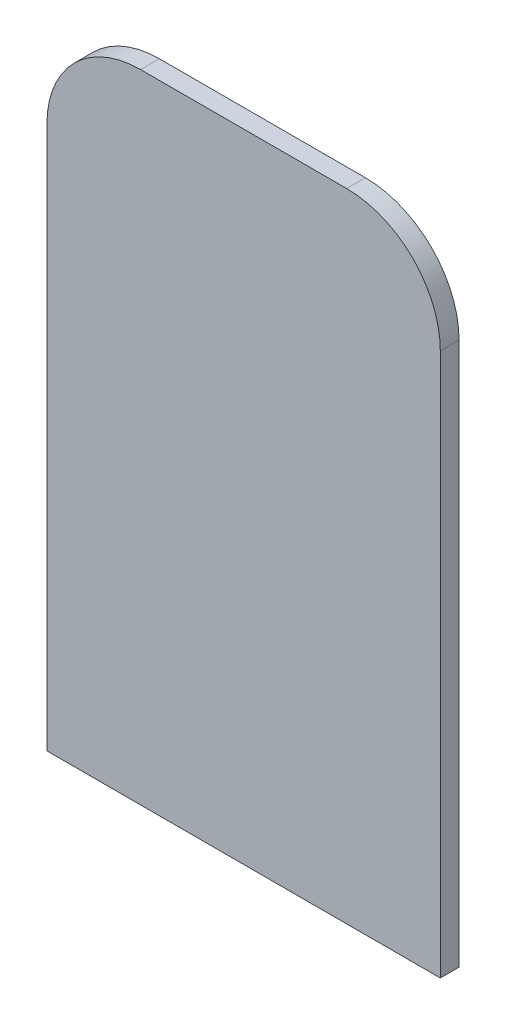
ISO-10303-21;
HEADER;
FILE_DESCRIPTION(('STEP AP214'),'2;1');
FILE_NAME('part.step','',(''),(''),'','','');
FILE_SCHEMA(('AUTOMOTIVE_DESIGN { 1 0 10303 214 1 1 1 1 }'));
ENDSEC;
DATA;
#1=APPLICATION_CONTEXT('core data for automotive mechanical design processes');
#2=APPLICATION_PROTOCOL_DEFINITION('international standard','automotive_design',2000,#1);
#3=PRODUCT_CONTEXT('',#1,'mechanical');
#4=PRODUCT('Part','Part','',(#3));
#5=PRODUCT_RELATED_PRODUCT_CATEGORY('part','',(#4));
#6=PRODUCT_DEFINITION_FORMATION('','',#4);
#7=PRODUCT_DEFINITION_CONTEXT('part definition',#1,'design');
#8=PRODUCT_DEFINITION('design','',#6,#7);
#9=PRODUCT_DEFINITION_SHAPE('','',#8);
#10=(LENGTH_UNIT() NAMED_UNIT(*) SI_UNIT(.MILLI.,.METRE.));
#11=(NAMED_UNIT(*) PLANE_ANGLE_UNIT() SI_UNIT($,.RADIAN.));
#12=(NAMED_UNIT(*) SI_UNIT($,.STERADIAN.) SOLID_ANGLE_UNIT());
#13=UNCERTAINTY_MEASURE_WITH_UNIT(LENGTH_MEASURE(1.E-05),#10,'distance_accuracy_value','');
#14=(GEOMETRIC_REPRESENTATION_CONTEXT(3) GLOBAL_UNCERTAINTY_ASSIGNED_CONTEXT((#13)) GLOBAL_UNIT_ASSIGNED_CONTEXT((#10,
#11,#12)) REPRESENTATION_CONTEXT('',''));
#15=CARTESIAN_POINT('',(0.,0.,0.));
#16=DIRECTION('',(0.,0.,1.));
#17=DIRECTION('',(1.,0.,0.));
#18=AXIS2_PLACEMENT_3D('',#15,#16,#17);
#19=CARTESIAN_POINT('',(5.5,29.,1.));
#20=DIRECTION('',(0.,0.,-1.));
#21=DIRECTION('',(-1.,0.,0.));
#22=AXIS2_PLACEMENT_3D('',#19,#20,#21);
#23=CYLINDRICAL_SURFACE('',#22,5.);
#24=CARTESIAN_POINT('',(5.5,29.,0.));
#25=DIRECTION('',(0.,0.,1.));
#26=DIRECTION('',(1.,0.,0.));
#27=AXIS2_PLACEMENT_3D('',#24,#25,#26);
#28=CIRCLE('',#27,5.);
#29=CARTESIAN_POINT('',(10.5,29.,0.));
#30=VERTEX_POINT('',#29);
#31=CARTESIAN_POINT('',(5.49999999999997,34.,0.));
#32=VERTEX_POINT('',#31);
#33=EDGE_CURVE('E158',#30,#32,#28,.T.);
#34=ORIENTED_EDGE('',*,*,#33,.T.);
#35=DIRECTION('',(0.,0.,-1.));
#36=VECTOR('',#35,1.);
#37=CARTESIAN_POINT('',(5.49999999999997,34.,1.));
#38=LINE('',#37,#36);
#39=CARTESIAN_POINT('',(5.49999999999997,34.,1.));
#40=VERTEX_POINT('',#39);
#41=EDGE_CURVE('E12',#40,#32,#38,.T.);
#42=ORIENTED_EDGE('',*,*,#41,.F.);
#43=CARTESIAN_POINT('',(5.5,29.,1.));
#44=DIRECTION('',(0.,0.,1.));
#45=DIRECTION('',(1.,0.,0.));
#46=AXIS2_PLACEMENT_3D('',#43,#44,#45);
#47=CIRCLE('',#46,5.);
#48=CARTESIAN_POINT('',(10.5,29.,1.));
#49=VERTEX_POINT('',#48);
#50=EDGE_CURVE('E137',#49,#40,#47,.T.);
#51=ORIENTED_EDGE('',*,*,#50,.F.);
#52=DIRECTION('',(0.,0.,-1.));
#53=VECTOR('',#52,1.);
#54=CARTESIAN_POINT('',(10.5,29.,1.));
#55=LINE('',#54,#53);
#56=EDGE_CURVE('E121',#49,#30,#55,.T.);
#57=ORIENTED_EDGE('',*,*,#56,.T.);
#58=EDGE_LOOP('',(#34,#42,#51,#57));
#59=FACE_BOUND('',#58,.T.);
#60=ADVANCED_FACE('F38',(#59),#23,.T.);
#61=CARTESIAN_POINT('',(-5.49999999999997,34.,1.));
#62=DIRECTION('',(0.,-1.,0.));
#63=DIRECTION('',(0.,0.,-1.));
#64=AXIS2_PLACEMENT_3D('',#61,#62,#63);
#65=PLANE('',#64);
#66=DIRECTION('',(-1.,0.,0.));
#67=VECTOR('',#66,1.);
#68=CARTESIAN_POINT('',(-5.49999999999997,34.,0.));
#69=LINE('',#68,#67);
#70=CARTESIAN_POINT('',(-5.49999999999997,34.,0.));
#71=VERTEX_POINT('',#70);
#72=EDGE_CURVE('E156',#32,#71,#69,.T.);
#73=ORIENTED_EDGE('',*,*,#72,.T.);
#74=DIRECTION('',(0.,0.,-1.));
#75=VECTOR('',#74,1.);
#76=CARTESIAN_POINT('',(-5.49999999999997,34.,1.));
#77=LINE('',#76,#75);
#78=CARTESIAN_POINT('',(-5.49999999999997,34.,1.));
#79=VERTEX_POINT('',#78);
#80=EDGE_CURVE('E46',#79,#71,#77,.T.);
#81=ORIENTED_EDGE('',*,*,#80,.F.);
#82=DIRECTION('',(-1.,0.,0.));
#83=VECTOR('',#82,1.);
#84=CARTESIAN_POINT('',(-5.49999999999997,34.,1.));
#85=LINE('',#84,#83);
#86=EDGE_CURVE('E91',#40,#79,#85,.T.);
#87=ORIENTED_EDGE('',*,*,#86,.F.);
#88=ORIENTED_EDGE('',*,*,#41,.T.);
#89=EDGE_LOOP('',(#73,#81,#87,#88));
#90=FACE_BOUND('',#89,.T.);
#91=ADVANCED_FACE('F173',(#90),#65,.F.);
#92=CARTESIAN_POINT('',(-5.5,29.,1.));
#93=DIRECTION('',(0.,0.,-1.));
#94=DIRECTION('',(-1.,0.,0.));
#95=AXIS2_PLACEMENT_3D('',#92,#93,#94);
#96=CYLINDRICAL_SURFACE('',#95,5.);
#97=CARTESIAN_POINT('',(-5.5,29.,0.));
#98=DIRECTION('',(0.,0.,1.));
#99=DIRECTION('',(-1.,0.,0.));
#100=AXIS2_PLACEMENT_3D('',#97,#98,#99);
#101=CIRCLE('',#100,5.);
#102=CARTESIAN_POINT('',(-10.5,29.,0.));
#103=VERTEX_POINT('',#102);
#104=EDGE_CURVE('E152',#71,#103,#101,.T.);
#105=ORIENTED_EDGE('',*,*,#104,.T.);
#106=DIRECTION('',(0.,0.,-1.));
#107=VECTOR('',#106,1.);
#108=CARTESIAN_POINT('',(-10.5,29.,1.));
#109=LINE('',#108,#107);
#110=CARTESIAN_POINT('',(-10.5,29.,1.));
#111=VERTEX_POINT('',#110);
#112=EDGE_CURVE('E114',#111,#103,#109,.T.);
#113=ORIENTED_EDGE('',*,*,#112,.F.);
#114=CARTESIAN_POINT('',(-5.5,29.,1.));
#115=DIRECTION('',(0.,0.,1.));
#116=DIRECTION('',(-1.,0.,0.));
#117=AXIS2_PLACEMENT_3D('',#114,#115,#116);
#118=CIRCLE('',#117,5.);
#119=EDGE_CURVE('E104',#79,#111,#118,.T.);
#120=ORIENTED_EDGE('',*,*,#119,.F.);
#121=ORIENTED_EDGE('',*,*,#80,.T.);
#122=EDGE_LOOP('',(#105,#113,#120,#121));
#123=FACE_BOUND('',#122,.T.);
#124=ADVANCED_FACE('F151',(#123),#96,.T.);
#125=CARTESIAN_POINT('',(-10.5,0.,1.));
#126=DIRECTION('',(1.,0.,0.));
#127=DIRECTION('',(0.,0.,-1.));
#128=AXIS2_PLACEMENT_3D('',#125,#126,#127);
#129=PLANE('',#128);
#130=DIRECTION('',(0.,-1.,0.));
#131=VECTOR('',#130,1.);
#132=CARTESIAN_POINT('',(-10.5,0.,0.));
#133=LINE('',#132,#131);
#134=CARTESIAN_POINT('',(-10.5,0.,0.));
#135=VERTEX_POINT('',#134);
#136=EDGE_CURVE('E113',#103,#135,#133,.T.);
#137=ORIENTED_EDGE('',*,*,#136,.T.);
#138=DIRECTION('',(0.,0.,-1.));
#139=VECTOR('',#138,1.);
#140=CARTESIAN_POINT('',(-10.5,0.,1.));
#141=LINE('',#140,#139);
#142=CARTESIAN_POINT('',(-10.5,0.,1.));
#143=VERTEX_POINT('',#142);
#144=EDGE_CURVE('E110',#143,#135,#141,.T.);
#145=ORIENTED_EDGE('',*,*,#144,.F.);
#146=DIRECTION('',(0.,-1.,0.));
#147=VECTOR('',#146,1.);
#148=CARTESIAN_POINT('',(-10.5,0.,1.));
#149=LINE('',#148,#147);
#150=EDGE_CURVE('E98',#111,#143,#149,.T.);
#151=ORIENTED_EDGE('',*,*,#150,.F.);
#152=ORIENTED_EDGE('',*,*,#112,.T.);
#153=EDGE_LOOP('',(#137,#145,#151,#152));
#154=FACE_BOUND('',#153,.T.);
#155=ADVANCED_FACE('F111',(#154),#129,.F.);
#156=CARTESIAN_POINT('',(10.5,0.,1.));
#157=DIRECTION('',(0.,1.,0.));
#158=DIRECTION('',(0.,0.,1.));
#159=AXIS2_PLACEMENT_3D('',#156,#157,#158);
#160=PLANE('',#159);
#161=DIRECTION('',(1.,0.,0.));
#162=VECTOR('',#161,1.);
#163=CARTESIAN_POINT('',(10.5,0.,0.));
#164=LINE('',#163,#162);
#165=CARTESIAN_POINT('',(10.5,0.,0.));
#166=VERTEX_POINT('',#165);
#167=EDGE_CURVE('E77',#135,#166,#164,.T.);
#168=ORIENTED_EDGE('',*,*,#167,.T.);
#169=DIRECTION('',(0.,0.,-1.));
#170=VECTOR('',#169,1.);
#171=CARTESIAN_POINT('',(10.5,0.,1.));
#172=LINE('',#171,#170);
#173=CARTESIAN_POINT('',(10.5,0.,1.));
#174=VERTEX_POINT('',#173);
#175=EDGE_CURVE('E115',#174,#166,#172,.T.);
#176=ORIENTED_EDGE('',*,*,#175,.F.);
#177=DIRECTION('',(1.,0.,0.));
#178=VECTOR('',#177,1.);
#179=CARTESIAN_POINT('',(10.5,0.,1.));
#180=LINE('',#179,#178);
#181=EDGE_CURVE('E102',#143,#174,#180,.T.);
#182=ORIENTED_EDGE('',*,*,#181,.F.);
#183=ORIENTED_EDGE('',*,*,#144,.T.);
#184=EDGE_LOOP('',(#168,#176,#182,#183));
#185=FACE_BOUND('',#184,.T.);
#186=ADVANCED_FACE('F117',(#185),#160,.F.);
#187=CARTESIAN_POINT('',(10.5,0.,1.));
#188=DIRECTION('',(-1.,0.,0.));
#189=DIRECTION('',(0.,0.,1.));
#190=AXIS2_PLACEMENT_3D('',#187,#188,#189);
#191=PLANE('',#190);
#192=DIRECTION('',(0.,1.,0.));
#193=VECTOR('',#192,1.);
#194=CARTESIAN_POINT('',(10.5,0.,0.));
#195=LINE('',#194,#193);
#196=EDGE_CURVE('E83',#166,#30,#195,.T.);
#197=ORIENTED_EDGE('',*,*,#196,.T.);
#198=ORIENTED_EDGE('',*,*,#56,.F.);
#199=DIRECTION('',(0.,1.,0.));
#200=VECTOR('',#199,1.);
#201=CARTESIAN_POINT('',(10.5,0.,1.));
#202=LINE('',#201,#200);
#203=EDGE_CURVE('E54',#174,#49,#202,.T.);
#204=ORIENTED_EDGE('',*,*,#203,.F.);
#205=ORIENTED_EDGE('',*,*,#175,.T.);
#206=EDGE_LOOP('',(#197,#198,#204,#205));
#207=FACE_BOUND('',#206,.T.);
#208=ADVANCED_FACE('F162',(#207),#191,.F.);
#209=CARTESIAN_POINT('',(5.5,29.,1.));
#210=DIRECTION('',(0.,0.,1.));
#211=DIRECTION('',(1.,0.,0.));
#212=AXIS2_PLACEMENT_3D('',#209,#210,#211);
#213=PLANE('',#212);
#214=ORIENTED_EDGE('',*,*,#50,.T.);
#215=ORIENTED_EDGE('',*,*,#86,.T.);
#216=ORIENTED_EDGE('',*,*,#119,.T.);
#217=ORIENTED_EDGE('',*,*,#150,.T.);
#218=ORIENTED_EDGE('',*,*,#181,.T.);
#219=ORIENTED_EDGE('',*,*,#203,.T.);
#220=EDGE_LOOP('',(#214,#215,#216,#217,#218,#219));
#221=FACE_BOUND('',#220,.T.);
#222=ADVANCED_FACE('F100',(#221),#213,.T.);
#223=CARTESIAN_POINT('',(5.5,29.,0.));
#224=DIRECTION('',(0.,0.,1.));
#225=DIRECTION('',(1.,0.,0.));
#226=AXIS2_PLACEMENT_3D('',#223,#224,#225);
#227=PLANE('',#226);
#228=ORIENTED_EDGE('',*,*,#33,.F.);
#229=ORIENTED_EDGE('',*,*,#196,.F.);
#230=ORIENTED_EDGE('',*,*,#167,.F.);
#231=ORIENTED_EDGE('',*,*,#136,.F.);
#232=ORIENTED_EDGE('',*,*,#104,.F.);
#233=ORIENTED_EDGE('',*,*,#72,.F.);
#234=EDGE_LOOP('',(#228,#229,#230,#231,#232,#233));
#235=FACE_BOUND('',#234,.T.);
#236=ADVANCED_FACE('F155',(#235),#227,.F.);
#237=CLOSED_SHELL('',(#60,#91,#124,#155,#186,#208,#222,#236));
#238=MANIFOLD_SOLID_BREP('B2',#237);
#239=ADVANCED_BREP_SHAPE_REPRESENTATION('',(#18,#238),#14);
#240=SHAPE_DEFINITION_REPRESENTATION(#9,#239);
ENDSEC;
END-ISO-10303-21;
